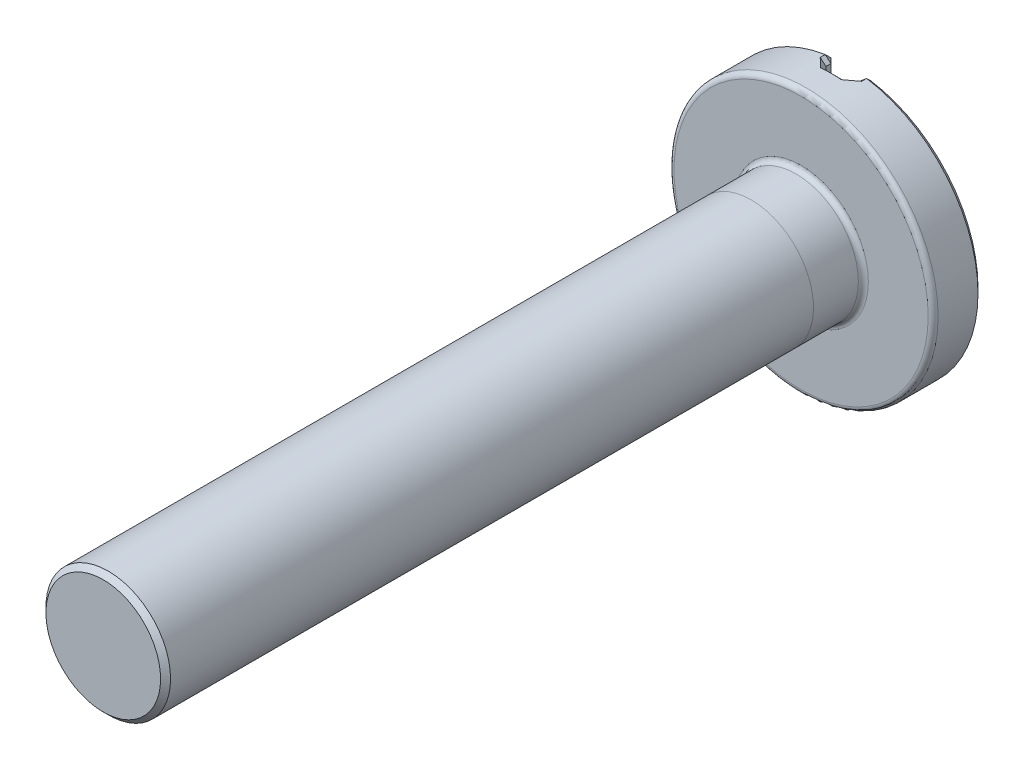
ISO-10303-21;
HEADER;
FILE_DESCRIPTION(('STEP AP214'),'2;1');
FILE_NAME('part.step','',(''),(''),'','','');
FILE_SCHEMA(('AUTOMOTIVE_DESIGN { 1 0 10303 214 1 1 1 1 }'));
ENDSEC;
DATA;
#1=APPLICATION_CONTEXT('core data for automotive mechanical design processes');
#2=APPLICATION_PROTOCOL_DEFINITION('international standard','automotive_design',2000,#1);
#3=PRODUCT_CONTEXT('',#1,'mechanical');
#4=PRODUCT('Part','Part','',(#3));
#5=PRODUCT_RELATED_PRODUCT_CATEGORY('part','',(#4));
#6=PRODUCT_DEFINITION_FORMATION('','',#4);
#7=PRODUCT_DEFINITION_CONTEXT('part definition',#1,'design');
#8=PRODUCT_DEFINITION('design','',#6,#7);
#9=PRODUCT_DEFINITION_SHAPE('','',#8);
#10=(LENGTH_UNIT() NAMED_UNIT(*) SI_UNIT(.MILLI.,.METRE.));
#11=(NAMED_UNIT(*) PLANE_ANGLE_UNIT() SI_UNIT($,.RADIAN.));
#12=(NAMED_UNIT(*) SI_UNIT($,.STERADIAN.) SOLID_ANGLE_UNIT());
#13=UNCERTAINTY_MEASURE_WITH_UNIT(LENGTH_MEASURE(1.E-05),#10,'distance_accuracy_value','');
#14=(GEOMETRIC_REPRESENTATION_CONTEXT(3) GLOBAL_UNCERTAINTY_ASSIGNED_CONTEXT((#13)) GLOBAL_UNIT_ASSIGNED_CONTEXT((#10,
#11,#12)) REPRESENTATION_CONTEXT('',''));
#15=CARTESIAN_POINT('',(0.,0.,0.));
#16=DIRECTION('',(0.,0.,1.));
#17=DIRECTION('',(1.,0.,0.));
#18=AXIS2_PLACEMENT_3D('',#15,#16,#17);
#19=CARTESIAN_POINT('',(0.,0.,7.));
#20=DIRECTION('',(0.,0.,-1.));
#21=DIRECTION('',(-1.,0.,0.));
#22=AXIS2_PLACEMENT_3D('',#19,#20,#21);
#23=CYLINDRICAL_SURFACE('',#22,0.625);
#24=CARTESIAN_POINT('',(0.,0.,6.95));
#25=DIRECTION('',(0.,0.,1.));
#26=DIRECTION('',(1.,0.,0.));
#27=AXIS2_PLACEMENT_3D('',#24,#25,#26);
#28=CIRCLE('',#27,0.625);
#29=CARTESIAN_POINT('',(0.625,0.,6.95));
#30=VERTEX_POINT('',#29);
#31=EDGE_CURVE('E49',#30,#30,#28,.F.);
#32=ORIENTED_EDGE('',*,*,#31,.T.);
#33=EDGE_LOOP('',(#32));
#34=FACE_BOUND('',#33,.T.);
#35=CARTESIAN_POINT('',(0.,0.,0.499999999999999));
#36=DIRECTION('',(0.,0.,-1.));
#37=DIRECTION('',(0.,1.,0.));
#38=AXIS2_PLACEMENT_3D('',#35,#36,#37);
#39=CIRCLE('',#38,0.625);
#40=CARTESIAN_POINT('',(0.,0.625,0.499999999999999));
#41=VERTEX_POINT('',#40);
#42=EDGE_CURVE('E11',#41,#41,#39,.T.);
#43=ORIENTED_EDGE('',*,*,#42,.F.);
#44=EDGE_LOOP('',(#43));
#45=FACE_BOUND('',#44,.T.);
#46=ADVANCED_FACE('F39',(#34,#45),#23,.T.);
#47=CARTESIAN_POINT('',(0.,0.,-0.5));
#48=DIRECTION('',(0.,0.,1.));
#49=DIRECTION('',(1.,0.,0.));
#50=AXIS2_PLACEMENT_3D('',#47,#48,#49);
#51=CYLINDRICAL_SURFACE('',#50,1.325);
#52=CARTESIAN_POINT('',(0.,0.,-0.05));
#53=DIRECTION('',(0.,0.,1.));
#54=DIRECTION('',(1.,0.,0.));
#55=AXIS2_PLACEMENT_3D('',#52,#53,#54);
#56=CIRCLE('',#55,1.325);
#57=CARTESIAN_POINT('',(1.325,0.,-0.05));
#58=VERTEX_POINT('',#57);
#59=EDGE_CURVE('E506',#58,#58,#56,.F.);
#60=ORIENTED_EDGE('',*,*,#59,.T.);
#61=EDGE_LOOP('',(#60));
#62=FACE_BOUND('',#61,.T.);
#63=CARTESIAN_POINT('',(0.207843137254902,-1.30859704657165,-0.4));
#64=CARTESIAN_POINT('',(0.198944612952266,-1.31001015516288,-0.391083323710143));
#65=CARTESIAN_POINT('',(0.189997133243153,-1.3113383968159,-0.382201765348476));
#66=CARTESIAN_POINT('',(0.171998203310304,-1.31382052719629,-0.364519994761565));
#67=CARTESIAN_POINT('',(0.162946752754306,-1.3149744153663,-0.355719782796444));
#68=CARTESIAN_POINT('',(0.137386181813813,-1.31796203945144,-0.331148582652646));
#69=CARTESIAN_POINT('',(0.120752529010109,-1.31959309958516,-0.315482355604768));
#70=CARTESIAN_POINT('',(0.10392156862745,-1.32091835764895,-0.3));
#71=B_SPLINE_CURVE_WITH_KNOTS('',3,(#63,#64,#65,#66,#67,#68,#69,#70),.UNSPECIFIED.,.F.,.F.,(4,2,
2,4),(0.,0.0380286734960458,0.0760574685548893,0.144770496492936),.UNSPECIFIED.);
#72=CARTESIAN_POINT('',(0.207843137254902,-1.30859704657165,-0.4));
#73=VERTEX_POINT('',#72);
#74=CARTESIAN_POINT('',(0.10392156862745,-1.32091835764895,-0.3));
#75=VERTEX_POINT('',#74);
#76=EDGE_CURVE('E251',#73,#75,#71,.T.);
#77=ORIENTED_EDGE('',*,*,#76,.F.);
#78=DIRECTION('',(0.,0.,1.));
#79=VECTOR('',#78,1.);
#80=CARTESIAN_POINT('',(0.207843137254902,-1.30859704657165,-0.5));
#81=LINE('',#80,#79);
#82=CARTESIAN_POINT('',(0.207843137254902,-1.30859704657165,-0.449999999999998));
#83=VERTEX_POINT('',#82);
#84=EDGE_CURVE('E249',#73,#83,#81,.F.);
#85=ORIENTED_EDGE('',*,*,#84,.T.);
#86=CARTESIAN_POINT('',(0.,0.,-0.449999999999998));
#87=DIRECTION('',(0.,0.,1.));
#88=DIRECTION('',(1.,0.,0.));
#89=AXIS2_PLACEMENT_3D('',#86,#87,#88);
#90=CIRCLE('',#89,1.325);
#91=CARTESIAN_POINT('',(0.207843137254902,1.30859704657165,-0.449999999999998));
#92=VERTEX_POINT('',#91);
#93=EDGE_CURVE('E245',#83,#92,#90,.T.);
#94=ORIENTED_EDGE('',*,*,#93,.T.);
#95=DIRECTION('',(0.,0.,1.));
#96=VECTOR('',#95,1.);
#97=CARTESIAN_POINT('',(0.207843137254902,1.30859704657165,-0.5));
#98=LINE('',#97,#96);
#99=CARTESIAN_POINT('',(0.207843137254902,1.30859704657165,-0.4));
#100=VERTEX_POINT('',#99);
#101=EDGE_CURVE('E236',#92,#100,#98,.T.);
#102=ORIENTED_EDGE('',*,*,#101,.T.);
#103=CARTESIAN_POINT('',(0.10392156862745,1.32091835764895,-0.3));
#104=CARTESIAN_POINT('',(0.113236467272082,1.3201852676791,-0.308567275963699));
#105=CARTESIAN_POINT('',(0.122490767260579,1.31935825110937,-0.317191695644925));
#106=CARTESIAN_POINT('',(0.140884473864295,1.31752124601971,-0.334542919242578));
#107=CARTESIAN_POINT('',(0.150023881068516,1.3165112584382,-0.343269722633687));
#108=CARTESIAN_POINT('',(0.17552459729029,1.31342642300711,-0.367891690895516));
#109=CARTESIAN_POINT('',(0.191763051988926,1.31114990369223,-0.383889412681226));
#110=CARTESIAN_POINT('',(0.207843137254902,1.30859704657165,-0.4));
#111=B_SPLINE_CURVE_WITH_KNOTS('',3,(#103,#104,#105,#106,#107,#108,#109,#110),.UNSPECIFIED.,.F.,
.F.,(4,2,2,4),(0.,0.0380291626217549,0.0760581302059457,0.144770913983084),.UNSPECIFIED.);
#112=CARTESIAN_POINT('',(0.10392156862745,1.32091835764895,-0.3));
#113=VERTEX_POINT('',#112);
#114=EDGE_CURVE('E229',#113,#100,#111,.T.);
#115=ORIENTED_EDGE('',*,*,#114,.F.);
#116=CARTESIAN_POINT('',(0.,0.,-0.3));
#117=DIRECTION('',(0.,0.,-1.));
#118=DIRECTION('',(-1.,0.,0.));
#119=AXIS2_PLACEMENT_3D('',#116,#117,#118);
#120=CIRCLE('',#119,1.325);
#121=CARTESIAN_POINT('',(-0.103921568627451,1.32091835764895,-0.3));
#122=VERTEX_POINT('',#121);
#123=EDGE_CURVE('E192',#113,#122,#120,.F.);
#124=ORIENTED_EDGE('',*,*,#123,.T.);
#125=CARTESIAN_POINT('',(-0.207843137254902,1.30859704657165,-0.4));
#126=CARTESIAN_POINT('',(-0.198944612952266,1.31001015516288,-0.391083323710143));
#127=CARTESIAN_POINT('',(-0.189997133243153,1.3113383968159,-0.382201765348476));
#128=CARTESIAN_POINT('',(-0.171998203310304,1.31382052719629,-0.364519994761565));
#129=CARTESIAN_POINT('',(-0.162946752754306,1.3149744153663,-0.355719782796444));
#130=CARTESIAN_POINT('',(-0.137386181813814,1.31796203945144,-0.331148582652646));
#131=CARTESIAN_POINT('',(-0.120752529010109,1.31959309958516,-0.315482355604768));
#132=CARTESIAN_POINT('',(-0.103921568627451,1.32091835764895,-0.3));
#133=B_SPLINE_CURVE_WITH_KNOTS('',3,(#125,#126,#127,#128,#129,#130,#131,#132),.UNSPECIFIED.,.F.,
.F.,(4,2,2,4),(0.,0.0380286734960458,0.0760574685548893,0.144770496492936),.UNSPECIFIED.);
#134=CARTESIAN_POINT('',(-0.207843137254902,1.30859704657165,-0.4));
#135=VERTEX_POINT('',#134);
#136=EDGE_CURVE('E183',#135,#122,#133,.T.);
#137=ORIENTED_EDGE('',*,*,#136,.F.);
#138=DIRECTION('',(0.,0.,1.));
#139=VECTOR('',#138,1.);
#140=CARTESIAN_POINT('',(-0.207843137254902,1.30859704657165,-0.5));
#141=LINE('',#140,#139);
#142=CARTESIAN_POINT('',(-0.207843137254902,1.30859704657165,-0.449999999999998));
#143=VERTEX_POINT('',#142);
#144=EDGE_CURVE('E180',#135,#143,#141,.F.);
#145=ORIENTED_EDGE('',*,*,#144,.T.);
#146=CARTESIAN_POINT('',(0.,0.,-0.449999999999998));
#147=DIRECTION('',(0.,0.,1.));
#148=DIRECTION('',(1.,0.,0.));
#149=AXIS2_PLACEMENT_3D('',#146,#147,#148);
#150=CIRCLE('',#149,1.325);
#151=CARTESIAN_POINT('',(-0.207843137254902,-1.30859704657165,-0.449999999999998));
#152=VERTEX_POINT('',#151);
#153=EDGE_CURVE('E175',#143,#152,#150,.T.);
#154=ORIENTED_EDGE('',*,*,#153,.T.);
#155=DIRECTION('',(0.,0.,1.));
#156=VECTOR('',#155,1.);
#157=CARTESIAN_POINT('',(-0.207843137254902,-1.30859704657165,-0.5));
#158=LINE('',#157,#156);
#159=CARTESIAN_POINT('',(-0.207843137254902,-1.30859704657165,-0.4));
#160=VERTEX_POINT('',#159);
#161=EDGE_CURVE('E150',#152,#160,#158,.T.);
#162=ORIENTED_EDGE('',*,*,#161,.T.);
#163=CARTESIAN_POINT('',(-0.103921568627451,-1.32091835764895,-0.3));
#164=CARTESIAN_POINT('',(-0.113236467272082,-1.32018526767909,-0.308567275963699));
#165=CARTESIAN_POINT('',(-0.122490767260579,-1.31935825110937,-0.317191695644925));
#166=CARTESIAN_POINT('',(-0.140884473864295,-1.31752124601971,-0.334542919242578));
#167=CARTESIAN_POINT('',(-0.150023881068516,-1.31651125843819,-0.343269722633688));
#168=CARTESIAN_POINT('',(-0.175524597290289,-1.31342642300711,-0.367891690895517));
#169=CARTESIAN_POINT('',(-0.191763051988926,-1.31114990369224,-0.383889412681227));
#170=CARTESIAN_POINT('',(-0.207843137254902,-1.30859704657165,-0.4));
#171=B_SPLINE_CURVE_WITH_KNOTS('',3,(#163,#164,#165,#166,#167,#168,#169,#170),.UNSPECIFIED.,.F.,
.F.,(4,2,2,4),(0.,0.0380291626217549,0.0760581302059456,0.144770913983083),.UNSPECIFIED.);
#172=CARTESIAN_POINT('',(-0.103921568627451,-1.32091835764895,-0.3));
#173=VERTEX_POINT('',#172);
#174=EDGE_CURVE('E238',#173,#160,#171,.T.);
#175=ORIENTED_EDGE('',*,*,#174,.F.);
#176=CARTESIAN_POINT('',(0.,0.,-0.3));
#177=DIRECTION('',(0.,0.,-1.));
#178=DIRECTION('',(-1.,0.,0.));
#179=AXIS2_PLACEMENT_3D('',#176,#177,#178);
#180=CIRCLE('',#179,1.325);
#181=EDGE_CURVE('E247',#173,#75,#180,.F.);
#182=ORIENTED_EDGE('',*,*,#181,.T.);
#183=EDGE_LOOP('',(#77,#85,#94,#102,#115,#124,#137,#145,#154,#162,#175,#182));
#184=FACE_BOUND('',#183,.T.);
#185=ADVANCED_FACE('F194',(#62,#184),#51,.T.);
#186=CARTESIAN_POINT('',(0.,0.,-0.5));
#187=DIRECTION('',(0.,0.,1.));
#188=DIRECTION('',(1.,0.,0.));
#189=AXIS2_PLACEMENT_3D('',#186,#187,#188);
#190=PLANE('',#189);
#191=CARTESIAN_POINT('',(0.,0.,-0.5));
#192=DIRECTION('',(0.,0.,1.));
#193=DIRECTION('',(1.,0.,0.));
#194=AXIS2_PLACEMENT_3D('',#191,#192,#193);
#195=CIRCLE('',#194,1.275);
#196=CARTESIAN_POINT('',(0.200000000000002,1.2592160259463,-0.5));
#197=VERTEX_POINT('',#196);
#198=CARTESIAN_POINT('',(0.200000000000002,-1.2592160259463,-0.5));
#199=VERTEX_POINT('',#198);
#200=EDGE_CURVE('E551',#197,#199,#195,.F.);
#201=ORIENTED_EDGE('',*,*,#200,.T.);
#202=DIRECTION('',(0.,1.,0.));
#203=VECTOR('',#202,1.);
#204=CARTESIAN_POINT('',(0.200000000000002,0.,-0.5));
#205=LINE('',#204,#203);
#206=EDGE_CURVE('E595',#199,#197,#205,.T.);
#207=ORIENTED_EDGE('',*,*,#206,.T.);
#208=EDGE_LOOP('',(#201,#207));
#209=FACE_BOUND('',#208,.T.);
#210=ADVANCED_FACE('F485',(#209),#190,.F.);
#211=ORIENTED_EDGE('',*,*,#42,.T.);
#212=EDGE_LOOP('',(#211));
#213=FACE_BOUND('',#212,.T.);
#214=CARTESIAN_POINT('',(0.,0.,0.0499999999999997));
#215=DIRECTION('',(0.,0.,1.));
#216=DIRECTION('',(1.,0.,0.));
#217=AXIS2_PLACEMENT_3D('',#214,#215,#216);
#218=CIRCLE('',#217,0.625);
#219=CARTESIAN_POINT('',(0.625,0.,0.0499999999999997));
#220=VERTEX_POINT('',#219);
#221=EDGE_CURVE('E504',#220,#220,#218,.T.);
#222=ORIENTED_EDGE('',*,*,#221,.T.);
#223=EDGE_LOOP('',(#222));
#224=FACE_BOUND('',#223,.T.);
#225=ADVANCED_FACE('F207',(#213,#224),#23,.T.);
#226=CARTESIAN_POINT('',(0.,0.,7.));
#227=DIRECTION('',(0.,0.,1.));
#228=DIRECTION('',(1.,0.,0.));
#229=AXIS2_PLACEMENT_3D('',#226,#227,#228);
#230=PLANE('',#229);
#231=CARTESIAN_POINT('',(0.,0.,7.));
#232=DIRECTION('',(0.,0.,1.));
#233=DIRECTION('',(1.,0.,0.));
#234=AXIS2_PLACEMENT_3D('',#231,#232,#233);
#235=CIRCLE('',#234,0.574999999999999);
#236=CARTESIAN_POINT('',(0.574999999999999,0.,7.));
#237=VERTEX_POINT('',#236);
#238=EDGE_CURVE('E505',#237,#237,#235,.T.);
#239=ORIENTED_EDGE('',*,*,#238,.T.);
#240=EDGE_LOOP('',(#239));
#241=FACE_BOUND('',#240,.T.);
#242=ADVANCED_FACE('F490',(#241),#230,.T.);
#243=CARTESIAN_POINT('',(0.,0.,-0.5));
#244=DIRECTION('',(0.,0.,1.));
#245=DIRECTION('',(1.,0.,0.));
#246=AXIS2_PLACEMENT_3D('',#243,#244,#245);
#247=CIRCLE('',#246,1.275);
#248=CARTESIAN_POINT('',(-0.200000000000002,-1.2592160259463,-0.5));
#249=VERTEX_POINT('',#248);
#250=CARTESIAN_POINT('',(-0.200000000000002,1.2592160259463,-0.5));
#251=VERTEX_POINT('',#250);
#252=EDGE_CURVE('E55',#249,#251,#247,.F.);
#253=ORIENTED_EDGE('',*,*,#252,.T.);
#254=DIRECTION('',(0.,-1.,0.));
#255=VECTOR('',#254,1.);
#256=CARTESIAN_POINT('',(-0.200000000000002,0.,-0.5));
#257=LINE('',#256,#255);
#258=EDGE_CURVE('E522',#251,#249,#257,.T.);
#259=ORIENTED_EDGE('',*,*,#258,.T.);
#260=EDGE_LOOP('',(#253,#259));
#261=FACE_BOUND('',#260,.T.);
#262=ADVANCED_FACE('F496',(#261),#190,.F.);
#263=CARTESIAN_POINT('',(0.,0.,0.));
#264=DIRECTION('',(0.,0.,1.));
#265=DIRECTION('',(1.,0.,0.));
#266=AXIS2_PLACEMENT_3D('',#263,#264,#265);
#267=PLANE('',#266);
#268=CARTESIAN_POINT('',(0.,0.,0.));
#269=DIRECTION('',(0.,0.,1.));
#270=DIRECTION('',(1.,0.,0.));
#271=AXIS2_PLACEMENT_3D('',#268,#269,#270);
#272=CIRCLE('',#271,1.275);
#273=CARTESIAN_POINT('',(1.275,0.,0.));
#274=VERTEX_POINT('',#273);
#275=EDGE_CURVE('E511',#274,#274,#272,.T.);
#276=ORIENTED_EDGE('',*,*,#275,.T.);
#277=EDGE_LOOP('',(#276));
#278=FACE_BOUND('',#277,.T.);
#279=CARTESIAN_POINT('',(0.,0.,0.));
#280=DIRECTION('',(0.,0.,1.));
#281=DIRECTION('',(1.,0.,0.));
#282=AXIS2_PLACEMENT_3D('',#279,#280,#281);
#283=CIRCLE('',#282,0.675);
#284=CARTESIAN_POINT('',(0.675,0.,0.));
#285=VERTEX_POINT('',#284);
#286=EDGE_CURVE('E519',#285,#285,#283,.F.);
#287=ORIENTED_EDGE('',*,*,#286,.T.);
#288=EDGE_LOOP('',(#287));
#289=FACE_BOUND('',#288,.T.);
#290=ADVANCED_FACE('F610',(#278,#289),#267,.T.);
#291=CARTESIAN_POINT('',(0.15,-5.11751622539691,-0.35));
#292=DIRECTION('',(1.,0.,0.));
#293=DIRECTION('',(0.,0.,-1.));
#294=AXIS2_PLACEMENT_3D('',#291,#292,#293);
#295=PLANE('',#294);
#296=DIRECTION('',(0.,0.,1.));
#297=VECTOR('',#296,1.);
#298=CARTESIAN_POINT('',(0.15,-1.2592160259463,-0.35));
#299=LINE('',#298,#297);
#300=CARTESIAN_POINT('',(0.15,-1.2592160259463,-0.449999999999998));
#301=VERTEX_POINT('',#300);
#302=CARTESIAN_POINT('',(0.15,-1.2592160259463,-0.4));
#303=VERTEX_POINT('',#302);
#304=EDGE_CURVE('E547',#301,#303,#299,.T.);
#305=ORIENTED_EDGE('',*,*,#304,.T.);
#306=DIRECTION('',(0.,1.,0.));
#307=VECTOR('',#306,1.);
#308=CARTESIAN_POINT('',(0.15,-5.11751622539691,-0.4));
#309=LINE('',#308,#307);
#310=CARTESIAN_POINT('',(0.15,1.2592160259463,-0.4));
#311=VERTEX_POINT('',#310);
#312=EDGE_CURVE('E865',#303,#311,#309,.T.);
#313=ORIENTED_EDGE('',*,*,#312,.T.);
#314=DIRECTION('',(0.,0.,-1.));
#315=VECTOR('',#314,1.);
#316=CARTESIAN_POINT('',(0.15,1.2592160259463,-0.5));
#317=LINE('',#316,#315);
#318=CARTESIAN_POINT('',(0.15,1.2592160259463,-0.449999999999998));
#319=VERTEX_POINT('',#318);
#320=EDGE_CURVE('E868',#311,#319,#317,.T.);
#321=ORIENTED_EDGE('',*,*,#320,.T.);
#322=DIRECTION('',(0.,-1.,0.));
#323=VECTOR('',#322,1.);
#324=CARTESIAN_POINT('',(0.15,-5.11751622539691,-0.449999999999998));
#325=LINE('',#324,#323);
#326=EDGE_CURVE('E258',#319,#301,#325,.T.);
#327=ORIENTED_EDGE('',*,*,#326,.T.);
#328=EDGE_LOOP('',(#305,#313,#321,#327));
#329=FACE_BOUND('',#328,.T.);
#330=ADVANCED_FACE('F614',(#329),#295,.F.);
#331=CARTESIAN_POINT('',(-0.15,-5.11751622539691,-0.35));
#332=DIRECTION('',(-1.,0.,0.));
#333=DIRECTION('',(0.,0.,1.));
#334=AXIS2_PLACEMENT_3D('',#331,#332,#333);
#335=PLANE('',#334);
#336=DIRECTION('',(0.,0.,1.));
#337=VECTOR('',#336,1.);
#338=CARTESIAN_POINT('',(-0.15,1.2592160259463,-0.35));
#339=LINE('',#338,#337);
#340=CARTESIAN_POINT('',(-0.15,1.2592160259463,-0.449999999999998));
#341=VERTEX_POINT('',#340);
#342=CARTESIAN_POINT('',(-0.15,1.2592160259463,-0.4));
#343=VERTEX_POINT('',#342);
#344=EDGE_CURVE('E167',#341,#343,#339,.T.);
#345=ORIENTED_EDGE('',*,*,#344,.T.);
#346=DIRECTION('',(0.,-1.,0.));
#347=VECTOR('',#346,1.);
#348=CARTESIAN_POINT('',(-0.15,-5.11751622539691,-0.4));
#349=LINE('',#348,#347);
#350=CARTESIAN_POINT('',(-0.15,-1.2592160259463,-0.4));
#351=VERTEX_POINT('',#350);
#352=EDGE_CURVE('E172',#343,#351,#349,.T.);
#353=ORIENTED_EDGE('',*,*,#352,.T.);
#354=DIRECTION('',(0.,0.,-1.));
#355=VECTOR('',#354,1.);
#356=CARTESIAN_POINT('',(-0.15,-1.2592160259463,-0.5));
#357=LINE('',#356,#355);
#358=CARTESIAN_POINT('',(-0.15,-1.2592160259463,-0.449999999999998));
#359=VERTEX_POINT('',#358);
#360=EDGE_CURVE('E148',#351,#359,#357,.T.);
#361=ORIENTED_EDGE('',*,*,#360,.T.);
#362=DIRECTION('',(0.,1.,0.));
#363=VECTOR('',#362,1.);
#364=CARTESIAN_POINT('',(-0.15,-5.11751622539691,-0.449999999999998));
#365=LINE('',#364,#363);
#366=EDGE_CURVE('E161',#359,#341,#365,.T.);
#367=ORIENTED_EDGE('',*,*,#366,.T.);
#368=EDGE_LOOP('',(#345,#353,#361,#367));
#369=FACE_BOUND('',#368,.T.);
#370=ADVANCED_FACE('F170',(#369),#335,.F.);
#371=CARTESIAN_POINT('',(0.,0.,-0.35));
#372=DIRECTION('',(0.,0.,-1.));
#373=DIRECTION('',(-1.,0.,0.));
#374=AXIS2_PLACEMENT_3D('',#371,#372,#373);
#375=PLANE('',#374);
#376=DIRECTION('',(0.,-1.,0.));
#377=VECTOR('',#376,1.);
#378=CARTESIAN_POINT('',(0.0999999999999994,0.,-0.35));
#379=LINE('',#378,#377);
#380=CARTESIAN_POINT('',(0.0999999999999994,1.27107238188862,-0.35));
#381=VERTEX_POINT('',#380);
#382=CARTESIAN_POINT('',(0.0999999999999994,-1.27107238188862,-0.35));
#383=VERTEX_POINT('',#382);
#384=EDGE_CURVE('E586',#381,#383,#379,.T.);
#385=ORIENTED_EDGE('',*,*,#384,.T.);
#386=CARTESIAN_POINT('',(0.,0.,-0.35));
#387=DIRECTION('',(0.,0.,-1.));
#388=DIRECTION('',(-1.,0.,0.));
#389=AXIS2_PLACEMENT_3D('',#386,#387,#388);
#390=CIRCLE('',#389,1.275);
#391=CARTESIAN_POINT('',(-0.0999999999999995,-1.27107238188862,-0.35));
#392=VERTEX_POINT('',#391);
#393=EDGE_CURVE('E565',#383,#392,#390,.T.);
#394=ORIENTED_EDGE('',*,*,#393,.T.);
#395=DIRECTION('',(0.,1.,0.));
#396=VECTOR('',#395,1.);
#397=CARTESIAN_POINT('',(-0.0999999999999995,0.,-0.35));
#398=LINE('',#397,#396);
#399=CARTESIAN_POINT('',(-0.0999999999999995,1.27107238188862,-0.35));
#400=VERTEX_POINT('',#399);
#401=EDGE_CURVE('E590',#392,#400,#398,.T.);
#402=ORIENTED_EDGE('',*,*,#401,.T.);
#403=CARTESIAN_POINT('',(0.,0.,-0.35));
#404=DIRECTION('',(0.,0.,-1.));
#405=DIRECTION('',(-1.,0.,0.));
#406=AXIS2_PLACEMENT_3D('',#403,#404,#405);
#407=CIRCLE('',#406,1.275);
#408=EDGE_CURVE('E583',#400,#381,#407,.T.);
#409=ORIENTED_EDGE('',*,*,#408,.T.);
#410=EDGE_LOOP('',(#385,#394,#402,#409));
#411=FACE_BOUND('',#410,.T.);
#412=ADVANCED_FACE('F467',(#411),#375,.T.);
#413=CARTESIAN_POINT('',(0.15,1.2592160259463,-0.449999999999998));
#414=DIRECTION('',(-0.544565628862047,0.637884434458259,-0.544565628862077));
#415=DIRECTION('',(0.,0.649283164305836,0.760546758949771));
#416=AXIS2_PLACEMENT_3D('',#413,#414,#415);
#417=PLANE('',#416);
#418=DIRECTION('',(0.760546758949789,0.649283164305815,0.));
#419=VECTOR('',#418,1.);
#420=CARTESIAN_POINT('',(0.15,1.2592160259463,-0.449999999999998));
#421=LINE('',#420,#419);
#422=EDGE_CURVE('E528',#92,#319,#421,.F.);
#423=ORIENTED_EDGE('',*,*,#422,.F.);
#424=DIRECTION('',(-0.11091871077434,-0.698353090921891,-0.707106781186548));
#425=VECTOR('',#424,1.);
#426=CARTESIAN_POINT('',(0.,0.,-1.77499999999998));
#427=LINE('',#426,#425);
#428=EDGE_CURVE('E168',#197,#92,#427,.F.);
#429=ORIENTED_EDGE('',*,*,#428,.F.);
#430=DIRECTION('',(0.707106781186548,0.,-0.707106781186548));
#431=VECTOR('',#430,1.);
#432=CARTESIAN_POINT('',(0.15,1.2592160259463,-0.449999999999998));
#433=LINE('',#432,#431);
#434=EDGE_CURVE('E525',#319,#197,#433,.T.);
#435=ORIENTED_EDGE('',*,*,#434,.F.);
#436=EDGE_LOOP('',(#423,#429,#435));
#437=FACE_BOUND('',#436,.T.);
#438=ADVANCED_FACE('F461',(#437),#417,.T.);
#439=CARTESIAN_POINT('',(0.,0.,-0.449999999999998));
#440=DIRECTION('',(0.,0.,1.));
#441=DIRECTION('',(1.,0.,0.));
#442=AXIS2_PLACEMENT_3D('',#439,#440,#441);
#443=CONICAL_SURFACE('',#442,1.325,0.785398163397448);
#444=ORIENTED_EDGE('',*,*,#428,.T.);
#445=ORIENTED_EDGE('',*,*,#93,.F.);
#446=DIRECTION('',(0.11091871077433,-0.698353090921892,0.707106781186547));
#447=VECTOR('',#446,1.);
#448=CARTESIAN_POINT('',(0.,0.,-1.77499999999998));
#449=LINE('',#448,#447);
#450=EDGE_CURVE('E531',#199,#83,#449,.T.);
#451=ORIENTED_EDGE('',*,*,#450,.F.);
#452=ORIENTED_EDGE('',*,*,#200,.F.);
#453=EDGE_LOOP('',(#444,#445,#451,#452));
#454=FACE_BOUND('',#453,.T.);
#455=ADVANCED_FACE('F455',(#454),#443,.T.);
#456=CARTESIAN_POINT('',(0.200000000000002,0.,-0.5));
#457=DIRECTION('',(0.707106781186548,0.,0.707106781186548));
#458=DIRECTION('',(0.,1.,0.));
#459=AXIS2_PLACEMENT_3D('',#456,#457,#458);
#460=PLANE('',#459);
#461=ORIENTED_EDGE('',*,*,#434,.T.);
#462=ORIENTED_EDGE('',*,*,#206,.F.);
#463=DIRECTION('',(-0.707106781186547,0.,0.707106781186547));
#464=VECTOR('',#463,1.);
#465=CARTESIAN_POINT('',(0.17892156862745,-1.2592160259463,-0.478921568627449));
#466=LINE('',#465,#464);
#467=EDGE_CURVE('E534',#301,#199,#466,.F.);
#468=ORIENTED_EDGE('',*,*,#467,.F.);
#469=ORIENTED_EDGE('',*,*,#326,.F.);
#470=EDGE_LOOP('',(#461,#462,#468,#469));
#471=FACE_BOUND('',#470,.T.);
#472=ADVANCED_FACE('F448',(#471),#460,.F.);
#473=CARTESIAN_POINT('',(0.15,1.2592160259463,-0.5));
#474=DIRECTION('',(-0.649283164305815,0.760546758949789,0.));
#475=DIRECTION('',(0.,0.,1.));
#476=AXIS2_PLACEMENT_3D('',#473,#474,#475);
#477=PLANE('',#476);
#478=ORIENTED_EDGE('',*,*,#422,.T.);
#479=ORIENTED_EDGE('',*,*,#320,.F.);
#480=DIRECTION('',(-0.760546758949788,-0.649283164305816,0.));
#481=VECTOR('',#480,1.);
#482=CARTESIAN_POINT('',(0.207843137254902,1.30859704657165,-0.4));
#483=LINE('',#482,#481);
#484=EDGE_CURVE('E536',#100,#311,#483,.T.);
#485=ORIENTED_EDGE('',*,*,#484,.F.);
#486=ORIENTED_EDGE('',*,*,#101,.F.);
#487=EDGE_LOOP('',(#478,#479,#485,#486));
#488=FACE_BOUND('',#487,.T.);
#489=ADVANCED_FACE('F441',(#488),#477,.T.);
#490=CARTESIAN_POINT('',(0.207843137254902,-1.30859704657165,-0.449999999999998));
#491=DIRECTION('',(-0.544565628862059,-0.637884434458251,-0.544565628862076));
#492=DIRECTION('',(0.,0.649283164305839,-0.760546758949768));
#493=AXIS2_PLACEMENT_3D('',#490,#491,#492);
#494=PLANE('',#493);
#495=ORIENTED_EDGE('',*,*,#467,.T.);
#496=ORIENTED_EDGE('',*,*,#450,.T.);
#497=DIRECTION('',(0.760546758949778,-0.649283164305828,0.));
#498=VECTOR('',#497,1.);
#499=CARTESIAN_POINT('',(0.207843137254902,-1.30859704657165,-0.449999999999998));
#500=LINE('',#499,#498);
#501=EDGE_CURVE('E396',#301,#83,#500,.T.);
#502=ORIENTED_EDGE('',*,*,#501,.F.);
#503=EDGE_LOOP('',(#495,#496,#502));
#504=FACE_BOUND('',#503,.T.);
#505=ADVANCED_FACE('F429',(#504),#494,.T.);
#506=CARTESIAN_POINT('',(0.0999999999999994,1.27107238188862,-0.35));
#507=CARTESIAN_POINT('',(0.15,1.2592160259463,-0.4));
#508=CARTESIAN_POINT('',(0.10392156862745,1.32091835764895,-0.3));
#509=CARTESIAN_POINT('',(0.207843137254902,1.30859704657165,-0.4));
#510=CARTESIAN_POINT('',(0.104024025887025,1.32222066357865,-0.29869366994042));
#511=CARTESIAN_POINT('',(0.209354381833632,1.30988720480396,-0.4));
#512=B_SPLINE_SURFACE_WITH_KNOTS('',1,1,((#506,#507),(#508,#509),(#510,#511)),.UNSPECIFIED.,.F.,
.F.,.F.,(2,1,2),(2,2),(0.,1.,1.0261266011916),(0.,1.),.UNSPECIFIED.);
#513=CARTESIAN_POINT('',(0.15,1.2592160259463,-0.4));
#514=CARTESIAN_POINT('',(0.145580136008863,1.26026409556021,-0.395580136008863));
#515=CARTESIAN_POINT('',(0.141160272017726,1.26131216517412,-0.391160272017726));
#516=CARTESIAN_POINT('',(0.132320544035451,1.26340830440195,-0.382320544035451));
#517=CARTESIAN_POINT('',(0.127900680044314,1.26445637401586,-0.377900680044314));
#518=CARTESIAN_POINT('',(0.115653877368784,1.26736042304938,-0.365653877368785));
#519=CARTESIAN_POINT('',(0.107826938684392,1.269216402469,-0.357826938684392));
#520=CARTESIAN_POINT('',(0.0999999999999994,1.27107238188862,-0.35));
#521=B_SPLINE_CURVE_WITH_KNOTS('',3,(#513,#514,#515,#516,#517,#518,#519,#520),.UNSPECIFIED.,.F.,
.F.,(4,2,2,4),(0.,0.0190136689737446,0.0380273379474893,0.0716977905951838),.UNSPECIFIED.);
#522=EDGE_CURVE('E387',#381,#311,#521,.F.);
#523=DIRECTION('',(0.0554593553871805,0.704928549499909,0.707106781186542));
#524=VECTOR('',#523,1.);
#525=CARTESIAN_POINT('',(0.0999999999999994,1.27107238188862,-0.35));
#526=LINE('',#525,#524);
#527=EDGE_CURVE('E397',#113,#381,#526,.F.);
#528=ORIENTED_EDGE('',*,*,#114,.T.);
#529=ORIENTED_EDGE('',*,*,#484,.T.);
#530=ORIENTED_EDGE('',*,*,#522,.F.);
#531=ORIENTED_EDGE('',*,*,#527,.F.);
#532=EDGE_LOOP('',(#528,#529,#530,#531));
#533=FACE_BOUND('',#532,.T.);
#534=ADVANCED_FACE('F420',(#533),#512,.T.);
#535=CARTESIAN_POINT('',(0.15,-1.2592160259463,-0.5));
#536=DIRECTION('',(0.649283164305828,0.760546758949778,0.));
#537=DIRECTION('',(0.,0.,1.));
#538=AXIS2_PLACEMENT_3D('',#535,#536,#537);
#539=PLANE('',#538);
#540=ORIENTED_EDGE('',*,*,#501,.T.);
#541=ORIENTED_EDGE('',*,*,#84,.F.);
#542=DIRECTION('',(0.760546758949778,-0.649283164305828,0.));
#543=VECTOR('',#542,1.);
#544=CARTESIAN_POINT('',(0.15,-1.2592160259463,-0.4));
#545=LINE('',#544,#543);
#546=EDGE_CURVE('E561',#303,#73,#545,.T.);
#547=ORIENTED_EDGE('',*,*,#546,.F.);
#548=ORIENTED_EDGE('',*,*,#304,.F.);
#549=EDGE_LOOP('',(#540,#541,#547,#548));
#550=FACE_BOUND('',#549,.T.);
#551=ADVANCED_FACE('F371',(#550),#539,.F.);
#552=CARTESIAN_POINT('',(0.0999999999999994,0.,-0.35));
#553=DIRECTION('',(0.707106781186541,0.,0.707106781186554));
#554=DIRECTION('',(0.,-1.,0.));
#555=AXIS2_PLACEMENT_3D('',#552,#553,#554);
#556=PLANE('',#555);
#557=ORIENTED_EDGE('',*,*,#522,.T.);
#558=ORIENTED_EDGE('',*,*,#312,.F.);
#559=CARTESIAN_POINT('',(0.0999999999999994,-1.27107238188862,-0.35));
#560=CARTESIAN_POINT('',(0.104419863991137,-1.2700243122747,-0.354419863991137));
#561=CARTESIAN_POINT('',(0.108839727982274,-1.26897624266079,-0.358839727982274));
#562=CARTESIAN_POINT('',(0.117679455964548,-1.26688010343297,-0.367679455964548));
#563=CARTESIAN_POINT('',(0.122099319955685,-1.26583203381906,-0.372099319955686));
#564=CARTESIAN_POINT('',(0.134346122631215,-1.26292798478553,-0.384346122631215));
#565=CARTESIAN_POINT('',(0.142173061315607,-1.26107200536592,-0.392173061315607));
#566=CARTESIAN_POINT('',(0.15,-1.2592160259463,-0.4));
#567=B_SPLINE_CURVE_WITH_KNOTS('',3,(#559,#560,#561,#562,#563,#564,#565,#566),.UNSPECIFIED.,.F.,
.F.,(4,2,2,4),(0.,0.0190136689737447,0.0380273379474893,0.071697790595184),.UNSPECIFIED.);
#568=EDGE_CURVE('E379',#383,#303,#567,.T.);
#569=ORIENTED_EDGE('',*,*,#568,.F.);
#570=ORIENTED_EDGE('',*,*,#384,.F.);
#571=EDGE_LOOP('',(#557,#558,#569,#570));
#572=FACE_BOUND('',#571,.T.);
#573=ADVANCED_FACE('F358',(#572),#556,.F.);
#574=CARTESIAN_POINT('',(0.,0.,-0.3));
#575=DIRECTION('',(0.,0.,1.));
#576=DIRECTION('',(1.,0.,0.));
#577=AXIS2_PLACEMENT_3D('',#574,#575,#576);
#578=CONICAL_SURFACE('',#577,1.325,0.785398163397457);
#579=ORIENTED_EDGE('',*,*,#527,.T.);
#580=ORIENTED_EDGE('',*,*,#408,.F.);
#581=DIRECTION('',(0.0554593553871805,-0.704928549499909,-0.707106781186542));
#582=VECTOR('',#581,1.);
#583=CARTESIAN_POINT('',(-0.103921568627451,1.32091835764895,-0.3));
#584=LINE('',#583,#582);
#585=EDGE_CURVE('E572',#122,#400,#584,.T.);
#586=ORIENTED_EDGE('',*,*,#585,.F.);
#587=ORIENTED_EDGE('',*,*,#123,.F.);
#588=EDGE_LOOP('',(#579,#580,#586,#587));
#589=FACE_BOUND('',#588,.T.);
#590=ADVANCED_FACE('F370',(#589),#578,.T.);
#591=CARTESIAN_POINT('',(-0.15,1.2592160259463,-0.5));
#592=DIRECTION('',(-0.649283164305828,-0.760546758949778,0.));
#593=DIRECTION('',(0.,0.,1.));
#594=AXIS2_PLACEMENT_3D('',#591,#592,#593);
#595=PLANE('',#594);
#596=DIRECTION('',(-0.760546758949778,0.649283164305828,0.));
#597=VECTOR('',#596,1.);
#598=CARTESIAN_POINT('',(-0.207843137254902,1.30859704657165,-0.449999999999998));
#599=LINE('',#598,#597);
#600=EDGE_CURVE('E566',#143,#341,#599,.F.);
#601=ORIENTED_EDGE('',*,*,#600,.F.);
#602=ORIENTED_EDGE('',*,*,#144,.F.);
#603=DIRECTION('',(-0.760546758949778,0.649283164305828,0.));
#604=VECTOR('',#603,1.);
#605=CARTESIAN_POINT('',(-0.15,1.2592160259463,-0.4));
#606=LINE('',#605,#604);
#607=EDGE_CURVE('E568',#343,#135,#606,.T.);
#608=ORIENTED_EDGE('',*,*,#607,.F.);
#609=ORIENTED_EDGE('',*,*,#344,.F.);
#610=EDGE_LOOP('',(#601,#602,#608,#609));
#611=FACE_BOUND('',#610,.T.);
#612=ADVANCED_FACE('F665',(#611),#595,.F.);
#613=CARTESIAN_POINT('',(0.15,-1.2592160259463,-0.4));
#614=CARTESIAN_POINT('',(0.0999999999999994,-1.27107238188862,-0.35));
#615=CARTESIAN_POINT('',(0.207843137254902,-1.30859704657165,-0.4));
#616=CARTESIAN_POINT('',(0.10392156862745,-1.32091835764895,-0.3));
#617=CARTESIAN_POINT('',(0.209333861546876,-1.30986968651654,-0.4));
#618=CARTESIAN_POINT('',(0.104022634681144,-1.32220298034491,-0.298711407815412));
#619=B_SPLINE_SURFACE_WITH_KNOTS('',1,1,((#613,#614),(#615,#616),(#617,#618)),.UNSPECIFIED.,.F.,
.F.,.F.,(2,1,2),(2,2),(0.,1.,1.02577184369176),(0.,1.),.UNSPECIFIED.);
#620=DIRECTION('',(-0.0554593553871805,0.704928549499909,-0.707106781186542));
#621=VECTOR('',#620,1.);
#622=CARTESIAN_POINT('',(0.10392156862745,-1.32091835764895,-0.3));
#623=LINE('',#622,#621);
#624=EDGE_CURVE('E316',#383,#75,#623,.F.);
#625=ORIENTED_EDGE('',*,*,#546,.T.);
#626=ORIENTED_EDGE('',*,*,#76,.T.);
#627=ORIENTED_EDGE('',*,*,#624,.F.);
#628=ORIENTED_EDGE('',*,*,#568,.T.);
#629=EDGE_LOOP('',(#625,#626,#627,#628));
#630=FACE_BOUND('',#629,.T.);
#631=ADVANCED_FACE('F356',(#630),#619,.T.);
#632=CARTESIAN_POINT('',(-0.15,1.2592160259463,-0.4));
#633=CARTESIAN_POINT('',(-0.0999999999999995,1.27107238188862,-0.35));
#634=CARTESIAN_POINT('',(-0.207843137254902,1.30859704657165,-0.4));
#635=CARTESIAN_POINT('',(-0.103921568627451,1.32091835764895,-0.3));
#636=CARTESIAN_POINT('',(-0.209333861546876,1.30986968651654,-0.4));
#637=CARTESIAN_POINT('',(-0.104022634681144,1.32220298034491,-0.298711407815412));
#638=B_SPLINE_SURFACE_WITH_KNOTS('',1,1,((#632,#633),(#634,#635),(#636,#637)),.UNSPECIFIED.,.F.,
.F.,.F.,(2,1,2),(2,2),(0.,1.,1.02577184369176),(0.,1.),.UNSPECIFIED.);
#639=CARTESIAN_POINT('',(-0.0999999999999995,1.27107238188862,-0.35));
#640=CARTESIAN_POINT('',(-0.104419863991137,1.2700243122747,-0.354419863991137));
#641=CARTESIAN_POINT('',(-0.108839727982274,1.26897624266079,-0.358839727982274));
#642=CARTESIAN_POINT('',(-0.117679455964548,1.26688010343297,-0.367679455964548));
#643=CARTESIAN_POINT('',(-0.122099319955685,1.26583203381906,-0.372099319955686));
#644=CARTESIAN_POINT('',(-0.134346122631215,1.26292798478553,-0.384346122631215));
#645=CARTESIAN_POINT('',(-0.142173061315608,1.26107200536592,-0.392173061315607));
#646=CARTESIAN_POINT('',(-0.15,1.2592160259463,-0.4));
#647=B_SPLINE_CURVE_WITH_KNOTS('',3,(#639,#640,#641,#642,#643,#644,#645,#646),.UNSPECIFIED.,.F.,
.F.,(4,2,2,4),(0.,0.0190136689737447,0.0380273379474893,0.071697790595184),.UNSPECIFIED.);
#648=EDGE_CURVE('E307',#343,#400,#647,.F.);
#649=ORIENTED_EDGE('',*,*,#136,.T.);
#650=ORIENTED_EDGE('',*,*,#585,.T.);
#651=ORIENTED_EDGE('',*,*,#648,.F.);
#652=ORIENTED_EDGE('',*,*,#607,.T.);
#653=EDGE_LOOP('',(#649,#650,#651,#652));
#654=FACE_BOUND('',#653,.T.);
#655=ADVANCED_FACE('F347',(#654),#638,.T.);
#656=CARTESIAN_POINT('',(-0.207843137254902,1.30859704657165,-0.449999999999998));
#657=DIRECTION('',(0.544565628862059,0.637884434458251,-0.544565628862076));
#658=DIRECTION('',(0.,0.649283164305839,0.760546758949768));
#659=AXIS2_PLACEMENT_3D('',#656,#657,#658);
#660=PLANE('',#659);
#661=DIRECTION('',(-0.11091871077433,0.698353090921892,0.707106781186547));
#662=VECTOR('',#661,1.);
#663=CARTESIAN_POINT('',(0.,0.,-1.77499999999998));
#664=LINE('',#663,#662);
#665=EDGE_CURVE('E608',#143,#251,#664,.F.);
#666=ORIENTED_EDGE('',*,*,#665,.F.);
#667=ORIENTED_EDGE('',*,*,#600,.T.);
#668=DIRECTION('',(0.707106781186547,0.,0.707106781186547));
#669=VECTOR('',#668,1.);
#670=CARTESIAN_POINT('',(-0.17892156862745,1.2592160259463,-0.478921568627449));
#671=LINE('',#670,#669);
#672=EDGE_CURVE('E164',#251,#341,#671,.T.);
#673=ORIENTED_EDGE('',*,*,#672,.F.);
#674=EDGE_LOOP('',(#666,#667,#673));
#675=FACE_BOUND('',#674,.T.);
#676=ADVANCED_FACE('F340',(#675),#660,.T.);
#677=CARTESIAN_POINT('',(0.,0.,-0.3));
#678=DIRECTION('',(0.,0.,1.));
#679=DIRECTION('',(1.,0.,0.));
#680=AXIS2_PLACEMENT_3D('',#677,#678,#679);
#681=CONICAL_SURFACE('',#680,1.325,0.785398163397457);
#682=ORIENTED_EDGE('',*,*,#624,.T.);
#683=ORIENTED_EDGE('',*,*,#181,.F.);
#684=DIRECTION('',(-0.0554593553871805,-0.704928549499909,0.707106781186542));
#685=VECTOR('',#684,1.);
#686=CARTESIAN_POINT('',(-0.0999999999999995,-1.27107238188862,-0.35));
#687=LINE('',#686,#685);
#688=EDGE_CURVE('E603',#392,#173,#687,.T.);
#689=ORIENTED_EDGE('',*,*,#688,.F.);
#690=ORIENTED_EDGE('',*,*,#393,.F.);
#691=EDGE_LOOP('',(#682,#683,#689,#690));
#692=FACE_BOUND('',#691,.T.);
#693=ADVANCED_FACE('F293',(#692),#681,.T.);
#694=CARTESIAN_POINT('',(-0.0999999999999995,0.,-0.35));
#695=DIRECTION('',(-0.707106781186541,0.,0.707106781186554));
#696=DIRECTION('',(0.,1.,0.));
#697=AXIS2_PLACEMENT_3D('',#694,#695,#696);
#698=PLANE('',#697);
#699=ORIENTED_EDGE('',*,*,#648,.T.);
#700=ORIENTED_EDGE('',*,*,#401,.F.);
#701=CARTESIAN_POINT('',(-0.15,-1.2592160259463,-0.4));
#702=CARTESIAN_POINT('',(-0.145580136008863,-1.26026409556021,-0.395580136008863));
#703=CARTESIAN_POINT('',(-0.141160272017726,-1.26131216517412,-0.391160272017726));
#704=CARTESIAN_POINT('',(-0.132320544035451,-1.26340830440195,-0.382320544035451));
#705=CARTESIAN_POINT('',(-0.127900680044314,-1.26445637401586,-0.377900680044314));
#706=CARTESIAN_POINT('',(-0.115653877368784,-1.26736042304938,-0.365653877368785));
#707=CARTESIAN_POINT('',(-0.107826938684392,-1.269216402469,-0.357826938684392));
#708=CARTESIAN_POINT('',(-0.0999999999999995,-1.27107238188862,-0.35));
#709=B_SPLINE_CURVE_WITH_KNOTS('',3,(#701,#702,#703,#704,#705,#706,#707,#708),.UNSPECIFIED.,.F.,
.F.,(4,2,2,4),(0.,0.0190136689737447,0.0380273379474893,0.071697790595184),.UNSPECIFIED.);
#710=EDGE_CURVE('E158',#351,#392,#709,.T.);
#711=ORIENTED_EDGE('',*,*,#710,.F.);
#712=ORIENTED_EDGE('',*,*,#352,.F.);
#713=EDGE_LOOP('',(#699,#700,#711,#712));
#714=FACE_BOUND('',#713,.T.);
#715=ADVANCED_FACE('F286',(#714),#698,.F.);
#716=CARTESIAN_POINT('',(-0.200000000000002,0.,-0.5));
#717=DIRECTION('',(-0.707106781186548,0.,0.707106781186548));
#718=DIRECTION('',(0.,-1.,0.));
#719=AXIS2_PLACEMENT_3D('',#716,#717,#718);
#720=PLANE('',#719);
#721=ORIENTED_EDGE('',*,*,#672,.T.);
#722=ORIENTED_EDGE('',*,*,#366,.F.);
#723=DIRECTION('',(-0.707106781186548,0.,-0.707106781186548));
#724=VECTOR('',#723,1.);
#725=CARTESIAN_POINT('',(-0.15,-1.2592160259463,-0.449999999999998));
#726=LINE('',#725,#724);
#727=EDGE_CURVE('E153',#249,#359,#726,.F.);
#728=ORIENTED_EDGE('',*,*,#727,.F.);
#729=ORIENTED_EDGE('',*,*,#258,.F.);
#730=EDGE_LOOP('',(#721,#722,#728,#729));
#731=FACE_BOUND('',#730,.T.);
#732=ADVANCED_FACE('F162',(#731),#720,.F.);
#733=CARTESIAN_POINT('',(0.,0.,-0.449999999999998));
#734=DIRECTION('',(0.,0.,1.));
#735=DIRECTION('',(1.,0.,0.));
#736=AXIS2_PLACEMENT_3D('',#733,#734,#735);
#737=CONICAL_SURFACE('',#736,1.325,0.785398163397448);
#738=ORIENTED_EDGE('',*,*,#665,.T.);
#739=ORIENTED_EDGE('',*,*,#252,.F.);
#740=DIRECTION('',(0.110918710774327,0.698353090921892,-0.707106781186547));
#741=VECTOR('',#740,1.);
#742=CARTESIAN_POINT('',(0.,0.,-1.77499999999998));
#743=LINE('',#742,#741);
#744=EDGE_CURVE('E63',#152,#249,#743,.T.);
#745=ORIENTED_EDGE('',*,*,#744,.F.);
#746=ORIENTED_EDGE('',*,*,#153,.F.);
#747=EDGE_LOOP('',(#738,#739,#745,#746));
#748=FACE_BOUND('',#747,.T.);
#749=ADVANCED_FACE('F607',(#748),#737,.T.);
#750=CARTESIAN_POINT('',(-0.0999999999999995,-1.27107238188862,-0.35));
#751=CARTESIAN_POINT('',(-0.15,-1.2592160259463,-0.4));
#752=CARTESIAN_POINT('',(-0.103921568627451,-1.32091835764895,-0.3));
#753=CARTESIAN_POINT('',(-0.207843137254902,-1.30859704657165,-0.4));
#754=CARTESIAN_POINT('',(-0.104024025887025,-1.32222066357865,-0.298693669940421));
#755=CARTESIAN_POINT('',(-0.209354381833631,-1.30988720480396,-0.4));
#756=B_SPLINE_SURFACE_WITH_KNOTS('',1,1,((#750,#751),(#752,#753),(#754,#755)),.UNSPECIFIED.,.F.,
.F.,.F.,(2,1,2),(2,2),(0.,1.,1.02612660119159),(0.,1.),.UNSPECIFIED.);
#757=DIRECTION('',(0.760546758949778,0.649283164305828,0.));
#758=VECTOR('',#757,1.);
#759=CARTESIAN_POINT('',(-0.207843137254902,-1.30859704657165,-0.4));
#760=LINE('',#759,#758);
#761=EDGE_CURVE('E151',#351,#160,#760,.F.);
#762=ORIENTED_EDGE('',*,*,#688,.T.);
#763=ORIENTED_EDGE('',*,*,#174,.T.);
#764=ORIENTED_EDGE('',*,*,#761,.F.);
#765=ORIENTED_EDGE('',*,*,#710,.T.);
#766=EDGE_LOOP('',(#762,#763,#764,#765));
#767=FACE_BOUND('',#766,.T.);
#768=ADVANCED_FACE('F285',(#767),#756,.T.);
#769=CARTESIAN_POINT('',(-0.15,-1.2592160259463,-0.449999999999998));
#770=DIRECTION('',(0.544565628862058,-0.63788443445825,-0.544565628862077));
#771=DIRECTION('',(0.,0.649283164305841,-0.760546758949766));
#772=AXIS2_PLACEMENT_3D('',#769,#770,#771);
#773=PLANE('',#772);
#774=ORIENTED_EDGE('',*,*,#744,.T.);
#775=ORIENTED_EDGE('',*,*,#727,.T.);
#776=DIRECTION('',(-0.760546758949778,-0.649283164305828,0.));
#777=VECTOR('',#776,1.);
#778=CARTESIAN_POINT('',(-0.15,-1.2592160259463,-0.449999999999998));
#779=LINE('',#778,#777);
#780=EDGE_CURVE('E145',#152,#359,#779,.F.);
#781=ORIENTED_EDGE('',*,*,#780,.F.);
#782=EDGE_LOOP('',(#774,#775,#781));
#783=FACE_BOUND('',#782,.T.);
#784=ADVANCED_FACE('F155',(#783),#773,.T.);
#785=CARTESIAN_POINT('',(-0.15,-1.2592160259463,-0.5));
#786=DIRECTION('',(0.649283164305828,-0.760546758949778,0.));
#787=DIRECTION('',(0.,0.,1.));
#788=AXIS2_PLACEMENT_3D('',#785,#786,#787);
#789=PLANE('',#788);
#790=ORIENTED_EDGE('',*,*,#761,.T.);
#791=ORIENTED_EDGE('',*,*,#161,.F.);
#792=ORIENTED_EDGE('',*,*,#780,.T.);
#793=ORIENTED_EDGE('',*,*,#360,.F.);
#794=EDGE_LOOP('',(#790,#791,#792,#793));
#795=FACE_BOUND('',#794,.T.);
#796=ADVANCED_FACE('F146',(#795),#789,.T.);
#797=CARTESIAN_POINT('',(0.,0.,-0.05));
#798=DIRECTION('',(0.,0.,1.));
#799=DIRECTION('',(1.,0.,0.));
#800=AXIS2_PLACEMENT_3D('',#797,#798,#799);
#801=TOROIDAL_SURFACE('',#800,1.275,0.05);
#802=ORIENTED_EDGE('',*,*,#59,.F.);
#803=EDGE_LOOP('',(#802));
#804=FACE_BOUND('',#803,.T.);
#805=ORIENTED_EDGE('',*,*,#275,.F.);
#806=EDGE_LOOP('',(#805));
#807=FACE_BOUND('',#806,.T.);
#808=ADVANCED_FACE('F279',(#804,#807),#801,.T.);
#809=CARTESIAN_POINT('',(0.,0.,0.0499999999999997));
#810=DIRECTION('',(0.,0.,1.));
#811=DIRECTION('',(1.,0.,0.));
#812=AXIS2_PLACEMENT_3D('',#809,#810,#811);
#813=TOROIDAL_SURFACE('',#812,0.675,0.05);
#814=ORIENTED_EDGE('',*,*,#286,.F.);
#815=EDGE_LOOP('',(#814));
#816=FACE_BOUND('',#815,.T.);
#817=ORIENTED_EDGE('',*,*,#221,.F.);
#818=EDGE_LOOP('',(#817));
#819=FACE_BOUND('',#818,.T.);
#820=ADVANCED_FACE('F470',(#816,#819),#813,.F.);
#821=CARTESIAN_POINT('',(0.,0.,7.));
#822=DIRECTION('',(0.,0.,-1.));
#823=DIRECTION('',(-1.,0.,0.));
#824=AXIS2_PLACEMENT_3D('',#821,#822,#823);
#825=CONICAL_SURFACE('',#824,0.574999999999999,0.78539816339746);
#826=ORIENTED_EDGE('',*,*,#31,.F.);
#827=EDGE_LOOP('',(#826));
#828=FACE_BOUND('',#827,.T.);
#829=ORIENTED_EDGE('',*,*,#238,.F.);
#830=EDGE_LOOP('',(#829));
#831=FACE_BOUND('',#830,.T.);
#832=ADVANCED_FACE('F42',(#828,#831),#825,.T.);
#833=CLOSED_SHELL('',(#46,#185,#210,#225,#242,#262,#290,#330,#370,#412,#438,#455,#472,#489,#505,
#534,#551,#573,#590,#612,#631,#655,#676,#693,#715,#732,#749,#768,#784,#796,#808,#820,#832));
#834=MANIFOLD_SOLID_BREP('B2',#833);
#835=ADVANCED_BREP_SHAPE_REPRESENTATION('',(#18,#834),#14);
#836=SHAPE_DEFINITION_REPRESENTATION(#9,#835);
ENDSEC;
END-ISO-10303-21;
